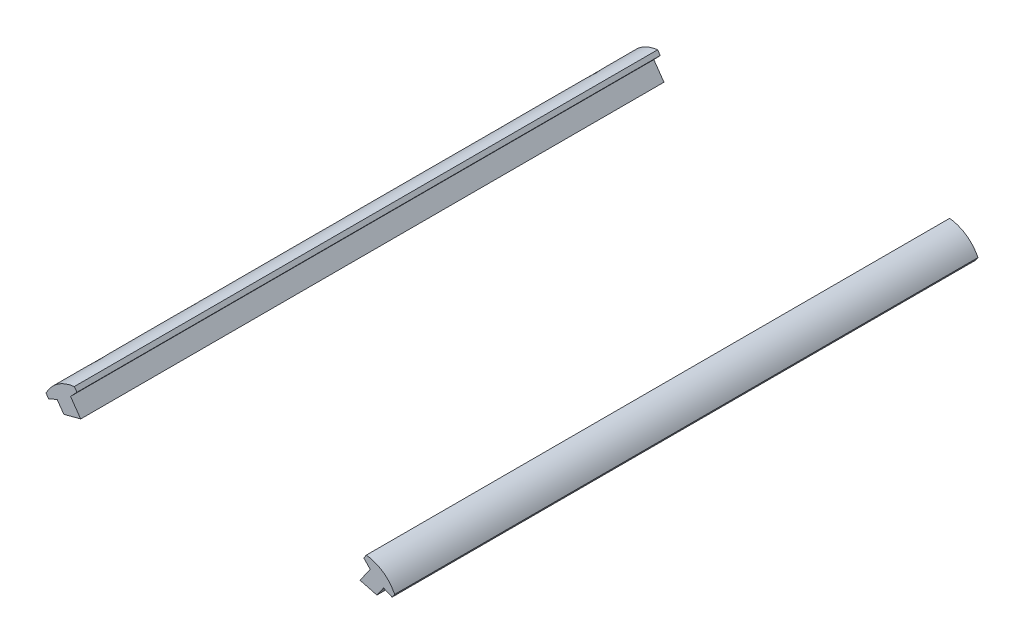
ISO-10303-21;
HEADER;
FILE_DESCRIPTION(('STEP AP214'),'2;1');
FILE_NAME('part.step','',(''),(''),'','','');
FILE_SCHEMA(('AUTOMOTIVE_DESIGN { 1 0 10303 214 1 1 1 1 }'));
ENDSEC;
DATA;
#1=APPLICATION_CONTEXT('core data for automotive mechanical design processes');
#2=APPLICATION_PROTOCOL_DEFINITION('international standard','automotive_design',2000,#1);
#3=PRODUCT_CONTEXT('',#1,'mechanical');
#4=PRODUCT('Part','Part','',(#3));
#5=PRODUCT_RELATED_PRODUCT_CATEGORY('part','',(#4));
#6=PRODUCT_DEFINITION_FORMATION('','',#4);
#7=PRODUCT_DEFINITION_CONTEXT('part definition',#1,'design');
#8=PRODUCT_DEFINITION('design','',#6,#7);
#9=PRODUCT_DEFINITION_SHAPE('','',#8);
#10=(LENGTH_UNIT() NAMED_UNIT(*) SI_UNIT(.MILLI.,.METRE.));
#11=(NAMED_UNIT(*) PLANE_ANGLE_UNIT() SI_UNIT($,.RADIAN.));
#12=(NAMED_UNIT(*) SI_UNIT($,.STERADIAN.) SOLID_ANGLE_UNIT());
#13=UNCERTAINTY_MEASURE_WITH_UNIT(LENGTH_MEASURE(1.E-05),#10,'distance_accuracy_value','');
#14=(GEOMETRIC_REPRESENTATION_CONTEXT(3) GLOBAL_UNCERTAINTY_ASSIGNED_CONTEXT((#13)) GLOBAL_UNIT_ASSIGNED_CONTEXT((#10,
#11,#12)) REPRESENTATION_CONTEXT('',''));
#15=CARTESIAN_POINT('',(0.,0.,0.));
#16=DIRECTION('',(0.,0.,1.));
#17=DIRECTION('',(1.,0.,0.));
#18=AXIS2_PLACEMENT_3D('',#15,#16,#17);
#19=CARTESIAN_POINT('',(0.,0.,152.4));
#20=DIRECTION('',(0.,0.,-1.));
#21=DIRECTION('',(-1.,0.,0.));
#22=AXIS2_PLACEMENT_3D('',#19,#20,#21);
#23=CYLINDRICAL_SURFACE('',#22,152.4);
#24=CARTESIAN_POINT('',(0.,0.,0.));
#25=DIRECTION('',(0.,0.,-1.));
#26=DIRECTION('',(1.,0.,0.));
#27=AXIS2_PLACEMENT_3D('',#24,#25,#26);
#28=CIRCLE('',#27,152.4);
#29=CARTESIAN_POINT('',(36.4912257801325,147.966720721463,0.));
#30=VERTEX_POINT('',#29);
#31=CARTESIAN_POINT('',(40.8893179170161,146.812205488104,0.));
#32=VERTEX_POINT('',#31);
#33=EDGE_CURVE('E139',#30,#32,#28,.T.);
#34=ORIENTED_EDGE('',*,*,#33,.T.);
#35=DIRECTION('',(0.,0.,-1.));
#36=VECTOR('',#35,1.);
#37=CARTESIAN_POINT('',(40.8893179170161,146.812205488104,152.4));
#38=LINE('',#37,#36);
#39=CARTESIAN_POINT('',(40.8893179170161,146.812205488104,152.4));
#40=VERTEX_POINT('',#39);
#41=EDGE_CURVE('E12',#40,#32,#38,.T.);
#42=ORIENTED_EDGE('',*,*,#41,.F.);
#43=CARTESIAN_POINT('',(0.,0.,152.4));
#44=DIRECTION('',(0.,0.,-1.));
#45=DIRECTION('',(1.,0.,0.));
#46=AXIS2_PLACEMENT_3D('',#43,#44,#45);
#47=CIRCLE('',#46,152.4);
#48=CARTESIAN_POINT('',(36.4912257801325,147.966720721463,152.4));
#49=VERTEX_POINT('',#48);
#50=EDGE_CURVE('E158',#49,#40,#47,.T.);
#51=ORIENTED_EDGE('',*,*,#50,.F.);
#52=DIRECTION('',(0.,0.,-1.));
#53=VECTOR('',#52,1.);
#54=CARTESIAN_POINT('',(36.4912257801325,147.966720721463,152.4));
#55=LINE('',#54,#53);
#56=EDGE_CURVE('E135',#49,#30,#55,.T.);
#57=ORIENTED_EDGE('',*,*,#56,.T.);
#58=EDGE_LOOP('',(#34,#42,#51,#57));
#59=FACE_BOUND('',#58,.T.);
#60=ADVANCED_FACE('F43',(#59),#23,.F.);
#61=CARTESIAN_POINT('',(40.8893179170161,146.812205488104,152.4));
#62=DIRECTION('',(-0.819209039548017,0.573495030076822,0.));
#63=DIRECTION('',(-0.573495030076822,-0.819209039548017,0.));
#64=AXIS2_PLACEMENT_3D('',#61,#62,#63);
#65=PLANE('',#64);
#66=DIRECTION('',(0.573495030076822,0.819209039548017,0.));
#67=VECTOR('',#66,1.);
#68=CARTESIAN_POINT('',(40.8893179170161,146.812205488104,0.));
#69=LINE('',#68,#67);
#70=CARTESIAN_POINT('',(42.6364173163982,149.307849819618,0.));
#71=VERTEX_POINT('',#70);
#72=EDGE_CURVE('E142',#32,#71,#69,.T.);
#73=ORIENTED_EDGE('',*,*,#72,.T.);
#74=DIRECTION('',(0.,0.,-1.));
#75=VECTOR('',#74,1.);
#76=CARTESIAN_POINT('',(42.6364173163982,149.307849819618,152.4));
#77=LINE('',#76,#75);
#78=CARTESIAN_POINT('',(42.6364173163982,149.307849819618,152.4));
#79=VERTEX_POINT('',#78);
#80=EDGE_CURVE('E51',#79,#71,#77,.T.);
#81=ORIENTED_EDGE('',*,*,#80,.F.);
#82=DIRECTION('',(0.573495030076822,0.819209039548017,0.));
#83=VECTOR('',#82,1.);
#84=CARTESIAN_POINT('',(40.8893179170161,146.812205488104,152.4));
#85=LINE('',#84,#83);
#86=EDGE_CURVE('E102',#40,#79,#85,.T.);
#87=ORIENTED_EDGE('',*,*,#86,.F.);
#88=ORIENTED_EDGE('',*,*,#41,.T.);
#89=EDGE_LOOP('',(#73,#81,#87,#88));
#90=FACE_BOUND('',#89,.T.);
#91=ADVANCED_FACE('F202',(#90),#65,.F.);
#92=CARTESIAN_POINT('',(42.6364173163982,149.307849819618,152.4));
#93=DIRECTION('',(0.396596742708751,0.917992932256457,0.));
#94=DIRECTION('',(-0.917992932256458,0.396596742708751,0.));
#95=AXIS2_PLACEMENT_3D('',#92,#93,#94);
#96=PLANE('',#95);
#97=DIRECTION('',(0.917992932256457,-0.396596742708751,0.));
#98=VECTOR('',#97,1.);
#99=CARTESIAN_POINT('',(42.6364173163982,149.307849819618,0.));
#100=LINE('',#99,#98);
#101=CARTESIAN_POINT('',(44.8750084067222,148.340720440422,0.));
#102=VERTEX_POINT('',#101);
#103=EDGE_CURVE('E144',#71,#102,#100,.T.);
#104=ORIENTED_EDGE('',*,*,#103,.T.);
#105=DIRECTION('',(0.,0.,-1.));
#106=VECTOR('',#105,1.);
#107=CARTESIAN_POINT('',(44.8750084067222,148.340720440422,152.4));
#108=LINE('',#107,#106);
#109=CARTESIAN_POINT('',(44.8750084067222,148.340720440422,152.4));
#110=VERTEX_POINT('',#109);
#111=EDGE_CURVE('E165',#110,#102,#108,.T.);
#112=ORIENTED_EDGE('',*,*,#111,.F.);
#113=DIRECTION('',(0.917992932256457,-0.396596742708751,0.));
#114=VECTOR('',#113,1.);
#115=CARTESIAN_POINT('',(42.6364173163982,149.307849819618,152.4));
#116=LINE('',#115,#114);
#117=EDGE_CURVE('E173',#79,#110,#116,.T.);
#118=ORIENTED_EDGE('',*,*,#117,.F.);
#119=ORIENTED_EDGE('',*,*,#80,.T.);
#120=EDGE_LOOP('',(#104,#112,#118,#119));
#121=FACE_BOUND('',#120,.T.);
#122=ADVANCED_FACE('F171',(#121),#96,.F.);
#123=CARTESIAN_POINT('',(44.8750084067222,148.340720440422,152.4));
#124=DIRECTION('',(-0.819209039548057,0.573495030076766,0.));
#125=DIRECTION('',(-0.573495030076766,-0.819209039548057,0.));
#126=AXIS2_PLACEMENT_3D('',#123,#124,#125);
#127=PLANE('',#126);
#128=DIRECTION('',(0.573495030076766,0.819209039548057,0.));
#129=VECTOR('',#128,1.);
#130=CARTESIAN_POINT('',(44.8750084067222,148.340720440422,0.));
#131=LINE('',#130,#129);
#132=CARTESIAN_POINT('',(45.552343010576,149.30825913069,0.));
#133=VERTEX_POINT('',#132);
#134=EDGE_CURVE('E146',#102,#133,#131,.T.);
#135=ORIENTED_EDGE('',*,*,#134,.T.);
#136=DIRECTION('',(0.,0.,-1.));
#137=VECTOR('',#136,1.);
#138=CARTESIAN_POINT('',(45.552343010576,149.30825913069,152.4));
#139=LINE('',#138,#137);
#140=CARTESIAN_POINT('',(45.552343010576,149.30825913069,152.4));
#141=VERTEX_POINT('',#140);
#142=EDGE_CURVE('E162',#141,#133,#139,.T.);
#143=ORIENTED_EDGE('',*,*,#142,.F.);
#144=DIRECTION('',(0.573495030076766,0.819209039548057,0.));
#145=VECTOR('',#144,1.);
#146=CARTESIAN_POINT('',(44.8750084067222,148.340720440422,152.4));
#147=LINE('',#146,#145);
#148=EDGE_CURVE('E185',#110,#141,#147,.T.);
#149=ORIENTED_EDGE('',*,*,#148,.F.);
#150=ORIENTED_EDGE('',*,*,#111,.T.);
#151=EDGE_LOOP('',(#135,#143,#149,#150));
#152=FACE_BOUND('',#151,.T.);
#153=ADVANCED_FACE('F181',(#152),#127,.F.);
#154=CARTESIAN_POINT('',(45.552343010576,149.30825913069,152.4));
#155=CARTESIAN_POINT('',(43.1806492590824,153.80374321664,152.4));
#156=CARTESIAN_POINT('',(38.144971739446,154.493859392463,152.4));
#157=B_SPLINE_CURVE_WITH_KNOTS('',2,(#154,#155,#156),.UNSPECIFIED.,.F.,.F.,(3,3),(0.,1.),.UNSPECIFIED.);
#158=DIRECTION('',(0.,0.,-1.));
#159=VECTOR('',#158,1.);
#160=SURFACE_OF_LINEAR_EXTRUSION('',#157,#159);
#161=CARTESIAN_POINT('',(45.552343010576,149.30825913069,0.));
#162=CARTESIAN_POINT('',(43.1806492590824,153.80374321664,0.));
#163=CARTESIAN_POINT('',(38.144971739446,154.493859392463,0.));
#164=B_SPLINE_CURVE_WITH_KNOTS('',2,(#161,#162,#163),.UNSPECIFIED.,.F.,.F.,(3,3),(0.,1.),.UNSPECIFIED.);
#165=CARTESIAN_POINT('',(38.144971739446,154.493859392463,0.));
#166=VERTEX_POINT('',#165);
#167=EDGE_CURVE('E148',#133,#166,#164,.T.);
#168=ORIENTED_EDGE('',*,*,#167,.T.);
#169=DIRECTION('',(0.,0.,-1.));
#170=VECTOR('',#169,1.);
#171=CARTESIAN_POINT('',(38.144971739446,154.493859392463,152.4));
#172=LINE('',#171,#170);
#173=CARTESIAN_POINT('',(38.144971739446,154.493859392463,152.4));
#174=VERTEX_POINT('',#173);
#175=EDGE_CURVE('E130',#174,#166,#172,.T.);
#176=ORIENTED_EDGE('',*,*,#175,.F.);
#177=EDGE_CURVE('E121',#141,#174,#157,.T.);
#178=ORIENTED_EDGE('',*,*,#177,.F.);
#179=ORIENTED_EDGE('',*,*,#142,.T.);
#180=EDGE_LOOP('',(#168,#176,#178,#179));
#181=FACE_BOUND('',#180,.T.);
#182=ADVANCED_FACE('F184',(#181),#160,.F.);
#183=CARTESIAN_POINT('',(37.467637135592,153.526320702195,152.4));
#184=DIRECTION('',(0.819209039548011,-0.57349503007683,0.));
#185=DIRECTION('',(0.57349503007683,0.819209039548011,0.));
#186=AXIS2_PLACEMENT_3D('',#183,#184,#185);
#187=PLANE('',#186);
#188=DIRECTION('',(-0.57349503007683,-0.819209039548011,0.));
#189=VECTOR('',#188,1.);
#190=CARTESIAN_POINT('',(37.467637135592,153.526320702195,0.));
#191=LINE('',#190,#189);
#192=CARTESIAN_POINT('',(37.467637135592,153.526320702195,0.));
#193=VERTEX_POINT('',#192);
#194=EDGE_CURVE('E129',#166,#193,#191,.T.);
#195=ORIENTED_EDGE('',*,*,#194,.T.);
#196=DIRECTION('',(0.,0.,-1.));
#197=VECTOR('',#196,1.);
#198=CARTESIAN_POINT('',(37.467637135592,153.526320702195,152.4));
#199=LINE('',#198,#197);
#200=CARTESIAN_POINT('',(37.467637135592,153.526320702195,152.4));
#201=VERTEX_POINT('',#200);
#202=EDGE_CURVE('E126',#201,#193,#199,.T.);
#203=ORIENTED_EDGE('',*,*,#202,.F.);
#204=DIRECTION('',(-0.57349503007683,-0.819209039548011,0.));
#205=VECTOR('',#204,1.);
#206=CARTESIAN_POINT('',(37.467637135592,153.526320702195,152.4));
#207=LINE('',#206,#205);
#208=EDGE_CURVE('E115',#174,#201,#207,.T.);
#209=ORIENTED_EDGE('',*,*,#208,.F.);
#210=ORIENTED_EDGE('',*,*,#175,.T.);
#211=EDGE_LOOP('',(#195,#203,#209,#210));
#212=FACE_BOUND('',#211,.T.);
#213=ADVANCED_FACE('F127',(#212),#187,.F.);
#214=CARTESIAN_POINT('',(39.1424370359007,151.753843734867,152.4));
#215=DIRECTION('',(0.726850622977677,0.686795582307402,0.));
#216=DIRECTION('',(-0.686795582307402,0.726850622977677,0.));
#217=AXIS2_PLACEMENT_3D('',#214,#215,#216);
#218=PLANE('',#217);
#219=DIRECTION('',(0.686795582307402,-0.726850622977677,0.));
#220=VECTOR('',#219,1.);
#221=CARTESIAN_POINT('',(39.1424370359007,151.753843734867,0.));
#222=LINE('',#221,#220);
#223=CARTESIAN_POINT('',(39.1424370359007,151.753843734867,0.));
#224=VERTEX_POINT('',#223);
#225=EDGE_CURVE('E88',#193,#224,#222,.T.);
#226=ORIENTED_EDGE('',*,*,#225,.T.);
#227=DIRECTION('',(0.,0.,-1.));
#228=VECTOR('',#227,1.);
#229=CARTESIAN_POINT('',(39.1424370359007,151.753843734867,152.4));
#230=LINE('',#229,#228);
#231=CARTESIAN_POINT('',(39.1424370359007,151.753843734867,152.4));
#232=VERTEX_POINT('',#231);
#233=EDGE_CURVE('E131',#232,#224,#230,.T.);
#234=ORIENTED_EDGE('',*,*,#233,.F.);
#235=DIRECTION('',(0.686795582307402,-0.726850622977677,0.));
#236=VECTOR('',#235,1.);
#237=CARTESIAN_POINT('',(39.1424370359007,151.753843734867,152.4));
#238=LINE('',#237,#236);
#239=EDGE_CURVE('E119',#201,#232,#238,.T.);
#240=ORIENTED_EDGE('',*,*,#239,.F.);
#241=ORIENTED_EDGE('',*,*,#202,.T.);
#242=EDGE_LOOP('',(#226,#234,#240,#241));
#243=FACE_BOUND('',#242,.T.);
#244=ADVANCED_FACE('F133',(#243),#218,.F.);
#245=CARTESIAN_POINT('',(36.4912257801325,147.966720721463,152.4));
#246=DIRECTION('',(0.819209039548021,-0.573495030076817,0.));
#247=DIRECTION('',(0.573495030076817,0.819209039548021,0.));
#248=AXIS2_PLACEMENT_3D('',#245,#246,#247);
#249=PLANE('',#248);
#250=DIRECTION('',(-0.573495030076817,-0.819209039548021,0.));
#251=VECTOR('',#250,1.);
#252=CARTESIAN_POINT('',(36.4912257801325,147.966720721463,0.));
#253=LINE('',#252,#251);
#254=EDGE_CURVE('E94',#224,#30,#253,.T.);
#255=ORIENTED_EDGE('',*,*,#254,.T.);
#256=ORIENTED_EDGE('',*,*,#56,.F.);
#257=DIRECTION('',(-0.573495030076817,-0.819209039548021,0.));
#258=VECTOR('',#257,1.);
#259=CARTESIAN_POINT('',(36.4912257801325,147.966720721463,152.4));
#260=LINE('',#259,#258);
#261=EDGE_CURVE('E59',#232,#49,#260,.T.);
#262=ORIENTED_EDGE('',*,*,#261,.F.);
#263=ORIENTED_EDGE('',*,*,#233,.T.);
#264=EDGE_LOOP('',(#255,#256,#262,#263));
#265=FACE_BOUND('',#264,.T.);
#266=ADVANCED_FACE('F210',(#265),#249,.F.);
#267=CARTESIAN_POINT('',(0.,0.,152.4));
#268=DIRECTION('',(0.,0.,1.));
#269=DIRECTION('',(1.,0.,0.));
#270=AXIS2_PLACEMENT_3D('',#267,#268,#269);
#271=PLANE('',#270);
#272=ORIENTED_EDGE('',*,*,#50,.T.);
#273=ORIENTED_EDGE('',*,*,#86,.T.);
#274=ORIENTED_EDGE('',*,*,#117,.T.);
#275=ORIENTED_EDGE('',*,*,#148,.T.);
#276=ORIENTED_EDGE('',*,*,#177,.T.);
#277=ORIENTED_EDGE('',*,*,#208,.T.);
#278=ORIENTED_EDGE('',*,*,#239,.T.);
#279=ORIENTED_EDGE('',*,*,#261,.T.);
#280=EDGE_LOOP('',(#272,#273,#274,#275,#276,#277,#278,#279));
#281=FACE_BOUND('',#280,.T.);
#282=ADVANCED_FACE('F117',(#281),#271,.T.);
#283=CARTESIAN_POINT('',(0.,0.,0.));
#284=DIRECTION('',(0.,0.,1.));
#285=DIRECTION('',(1.,0.,0.));
#286=AXIS2_PLACEMENT_3D('',#283,#284,#285);
#287=PLANE('',#286);
#288=ORIENTED_EDGE('',*,*,#33,.F.);
#289=ORIENTED_EDGE('',*,*,#254,.F.);
#290=ORIENTED_EDGE('',*,*,#225,.F.);
#291=ORIENTED_EDGE('',*,*,#194,.F.);
#292=ORIENTED_EDGE('',*,*,#167,.F.);
#293=ORIENTED_EDGE('',*,*,#134,.F.);
#294=ORIENTED_EDGE('',*,*,#103,.F.);
#295=ORIENTED_EDGE('',*,*,#72,.F.);
#296=EDGE_LOOP('',(#288,#289,#290,#291,#292,#293,#294,#295));
#297=FACE_BOUND('',#296,.T.);
#298=ADVANCED_FACE('F177',(#297),#287,.F.);
#299=CLOSED_SHELL('',(#60,#91,#122,#153,#182,#213,#244,#266,#282,#298));
#300=MANIFOLD_SOLID_BREP('B2',#299);
#301=CARTESIAN_POINT('',(0.,0.,152.4));
#302=DIRECTION('',(0.,0.,-1.));
#303=DIRECTION('',(-1.,0.,0.));
#304=AXIS2_PLACEMENT_3D('',#301,#302,#303);
#305=CYLINDRICAL_SURFACE('',#304,152.4);
#306=CARTESIAN_POINT('',(0.,0.,0.));
#307=DIRECTION('',(0.,0.,-1.));
#308=DIRECTION('',(1.,0.,0.));
#309=AXIS2_PLACEMENT_3D('',#306,#307,#308);
#310=CIRCLE('',#309,152.4);
#311=CARTESIAN_POINT('',(-40.8893179170162,146.812205488104,0.));
#312=VERTEX_POINT('',#311);
#313=CARTESIAN_POINT('',(-36.4912257801324,147.966720721463,0.));
#314=VERTEX_POINT('',#313);
#315=EDGE_CURVE('E378',#312,#314,#310,.T.);
#316=ORIENTED_EDGE('',*,*,#315,.T.);
#317=DIRECTION('',(0.,0.,-1.));
#318=VECTOR('',#317,1.);
#319=CARTESIAN_POINT('',(-36.4912257801324,147.966720721463,152.4));
#320=LINE('',#319,#318);
#321=CARTESIAN_POINT('',(-36.4912257801324,147.966720721463,152.4));
#322=VERTEX_POINT('',#321);
#323=EDGE_CURVE('E41',#322,#314,#320,.T.);
#324=ORIENTED_EDGE('',*,*,#323,.F.);
#325=CARTESIAN_POINT('',(0.,0.,152.4));
#326=DIRECTION('',(0.,0.,-1.));
#327=DIRECTION('',(1.,0.,0.));
#328=AXIS2_PLACEMENT_3D('',#325,#326,#327);
#329=CIRCLE('',#328,152.4);
#330=CARTESIAN_POINT('',(-40.8893179170162,146.812205488104,152.4));
#331=VERTEX_POINT('',#330);
#332=EDGE_CURVE('E397',#331,#322,#329,.T.);
#333=ORIENTED_EDGE('',*,*,#332,.F.);
#334=DIRECTION('',(0.,0.,-1.));
#335=VECTOR('',#334,1.);
#336=CARTESIAN_POINT('',(-40.8893179170162,146.812205488104,152.4));
#337=LINE('',#336,#335);
#338=EDGE_CURVE('E374',#331,#312,#337,.T.);
#339=ORIENTED_EDGE('',*,*,#338,.T.);
#340=EDGE_LOOP('',(#316,#324,#333,#339));
#341=FACE_BOUND('',#340,.T.);
#342=ADVANCED_FACE('F282',(#341),#305,.F.);
#343=CARTESIAN_POINT('',(-36.4912257801324,147.966720721463,152.4));
#344=DIRECTION('',(-0.819209039548009,-0.573495030076833,0.));
#345=DIRECTION('',(0.573495030076833,-0.81920903954801,0.));
#346=AXIS2_PLACEMENT_3D('',#343,#344,#345);
#347=PLANE('',#346);
#348=DIRECTION('',(-0.573495030076833,0.819209039548009,0.));
#349=VECTOR('',#348,1.);
#350=CARTESIAN_POINT('',(-36.4912257801324,147.966720721463,0.));
#351=LINE('',#350,#349);
#352=CARTESIAN_POINT('',(-39.1424370359007,151.753843734867,0.));
#353=VERTEX_POINT('',#352);
#354=EDGE_CURVE('E381',#314,#353,#351,.T.);
#355=ORIENTED_EDGE('',*,*,#354,.T.);
#356=DIRECTION('',(0.,0.,-1.));
#357=VECTOR('',#356,1.);
#358=CARTESIAN_POINT('',(-39.1424370359007,151.753843734867,152.4));
#359=LINE('',#358,#357);
#360=CARTESIAN_POINT('',(-39.1424370359007,151.753843734867,152.4));
#361=VERTEX_POINT('',#360);
#362=EDGE_CURVE('E290',#361,#353,#359,.T.);
#363=ORIENTED_EDGE('',*,*,#362,.F.);
#364=DIRECTION('',(-0.573495030076833,0.819209039548009,0.));
#365=VECTOR('',#364,1.);
#366=CARTESIAN_POINT('',(-36.4912257801324,147.966720721463,152.4));
#367=LINE('',#366,#365);
#368=EDGE_CURVE('E341',#322,#361,#367,.T.);
#369=ORIENTED_EDGE('',*,*,#368,.F.);
#370=ORIENTED_EDGE('',*,*,#323,.T.);
#371=EDGE_LOOP('',(#355,#363,#369,#370));
#372=FACE_BOUND('',#371,.T.);
#373=ADVANCED_FACE('F441',(#372),#347,.F.);
#374=CARTESIAN_POINT('',(-39.1424370359007,151.753843734867,152.4));
#375=DIRECTION('',(-0.726850622977677,0.686795582307402,0.));
#376=DIRECTION('',(-0.686795582307402,-0.726850622977677,0.));
#377=AXIS2_PLACEMENT_3D('',#374,#375,#376);
#378=PLANE('',#377);
#379=DIRECTION('',(0.686795582307402,0.726850622977677,0.));
#380=VECTOR('',#379,1.);
#381=CARTESIAN_POINT('',(-39.1424370359007,151.753843734867,0.));
#382=LINE('',#381,#380);
#383=CARTESIAN_POINT('',(-37.467637135592,153.526320702195,0.));
#384=VERTEX_POINT('',#383);
#385=EDGE_CURVE('E383',#353,#384,#382,.T.);
#386=ORIENTED_EDGE('',*,*,#385,.T.);
#387=DIRECTION('',(0.,0.,-1.));
#388=VECTOR('',#387,1.);
#389=CARTESIAN_POINT('',(-37.467637135592,153.526320702195,152.4));
#390=LINE('',#389,#388);
#391=CARTESIAN_POINT('',(-37.467637135592,153.526320702195,152.4));
#392=VERTEX_POINT('',#391);
#393=EDGE_CURVE('E404',#392,#384,#390,.T.);
#394=ORIENTED_EDGE('',*,*,#393,.F.);
#395=DIRECTION('',(0.686795582307402,0.726850622977677,0.));
#396=VECTOR('',#395,1.);
#397=CARTESIAN_POINT('',(-39.1424370359007,151.753843734867,152.4));
#398=LINE('',#397,#396);
#399=EDGE_CURVE('E412',#361,#392,#398,.T.);
#400=ORIENTED_EDGE('',*,*,#399,.F.);
#401=ORIENTED_EDGE('',*,*,#362,.T.);
#402=EDGE_LOOP('',(#386,#394,#400,#401));
#403=FACE_BOUND('',#402,.T.);
#404=ADVANCED_FACE('F410',(#403),#378,.F.);
#405=CARTESIAN_POINT('',(-37.467637135592,153.526320702195,152.4));
#406=DIRECTION('',(-0.819209039548011,-0.57349503007683,0.));
#407=DIRECTION('',(0.57349503007683,-0.819209039548011,0.));
#408=AXIS2_PLACEMENT_3D('',#405,#406,#407);
#409=PLANE('',#408);
#410=DIRECTION('',(-0.57349503007683,0.819209039548011,0.));
#411=VECTOR('',#410,1.);
#412=CARTESIAN_POINT('',(-37.467637135592,153.526320702195,0.));
#413=LINE('',#412,#411);
#414=CARTESIAN_POINT('',(-38.144971739446,154.493859392463,0.));
#415=VERTEX_POINT('',#414);
#416=EDGE_CURVE('E385',#384,#415,#413,.T.);
#417=ORIENTED_EDGE('',*,*,#416,.T.);
#418=DIRECTION('',(0.,0.,-1.));
#419=VECTOR('',#418,1.);
#420=CARTESIAN_POINT('',(-38.144971739446,154.493859392463,152.4));
#421=LINE('',#420,#419);
#422=CARTESIAN_POINT('',(-38.144971739446,154.493859392463,152.4));
#423=VERTEX_POINT('',#422);
#424=EDGE_CURVE('E401',#423,#415,#421,.T.);
#425=ORIENTED_EDGE('',*,*,#424,.F.);
#426=DIRECTION('',(-0.57349503007683,0.819209039548011,0.));
#427=VECTOR('',#426,1.);
#428=CARTESIAN_POINT('',(-37.467637135592,153.526320702195,152.4));
#429=LINE('',#428,#427);
#430=EDGE_CURVE('E424',#392,#423,#429,.T.);
#431=ORIENTED_EDGE('',*,*,#430,.F.);
#432=ORIENTED_EDGE('',*,*,#393,.T.);
#433=EDGE_LOOP('',(#417,#425,#431,#432));
#434=FACE_BOUND('',#433,.T.);
#435=ADVANCED_FACE('F420',(#434),#409,.F.);
#436=CARTESIAN_POINT('',(-38.144971739446,154.493859392463,152.4));
#437=CARTESIAN_POINT('',(-43.1806492590824,153.80374321664,152.4));
#438=CARTESIAN_POINT('',(-45.552343010576,149.30825913069,152.4));
#439=B_SPLINE_CURVE_WITH_KNOTS('',2,(#436,#437,#438),.UNSPECIFIED.,.F.,.F.,(3,3),(0.,1.),.UNSPECIFIED.);
#440=DIRECTION('',(0.,0.,-1.));
#441=VECTOR('',#440,1.);
#442=SURFACE_OF_LINEAR_EXTRUSION('',#439,#441);
#443=CARTESIAN_POINT('',(-38.144971739446,154.493859392463,0.));
#444=CARTESIAN_POINT('',(-43.1806492590824,153.80374321664,0.));
#445=CARTESIAN_POINT('',(-45.552343010576,149.30825913069,0.));
#446=B_SPLINE_CURVE_WITH_KNOTS('',2,(#443,#444,#445),.UNSPECIFIED.,.F.,.F.,(3,3),(0.,1.),.UNSPECIFIED.);
#447=CARTESIAN_POINT('',(-45.552343010576,149.30825913069,0.));
#448=VERTEX_POINT('',#447);
#449=EDGE_CURVE('E387',#415,#448,#446,.T.);
#450=ORIENTED_EDGE('',*,*,#449,.T.);
#451=DIRECTION('',(0.,0.,-1.));
#452=VECTOR('',#451,1.);
#453=CARTESIAN_POINT('',(-45.552343010576,149.30825913069,152.4));
#454=LINE('',#453,#452);
#455=CARTESIAN_POINT('',(-45.552343010576,149.30825913069,152.4));
#456=VERTEX_POINT('',#455);
#457=EDGE_CURVE('E369',#456,#448,#454,.T.);
#458=ORIENTED_EDGE('',*,*,#457,.F.);
#459=EDGE_CURVE('E360',#423,#456,#439,.T.);
#460=ORIENTED_EDGE('',*,*,#459,.F.);
#461=ORIENTED_EDGE('',*,*,#424,.T.);
#462=EDGE_LOOP('',(#450,#458,#460,#461));
#463=FACE_BOUND('',#462,.T.);
#464=ADVANCED_FACE('F423',(#463),#442,.F.);
#465=CARTESIAN_POINT('',(-44.8750084067222,148.340720440422,152.4));
#466=DIRECTION('',(0.819209039547993,0.573495030076857,0.));
#467=DIRECTION('',(-0.573495030076857,0.819209039547993,0.));
#468=AXIS2_PLACEMENT_3D('',#465,#466,#467);
#469=PLANE('',#468);
#470=DIRECTION('',(0.573495030076857,-0.819209039547993,0.));
#471=VECTOR('',#470,1.);
#472=CARTESIAN_POINT('',(-44.8750084067222,148.340720440422,0.));
#473=LINE('',#472,#471);
#474=CARTESIAN_POINT('',(-44.8750084067222,148.340720440422,0.));
#475=VERTEX_POINT('',#474);
#476=EDGE_CURVE('E368',#448,#475,#473,.T.);
#477=ORIENTED_EDGE('',*,*,#476,.T.);
#478=DIRECTION('',(0.,0.,-1.));
#479=VECTOR('',#478,1.);
#480=CARTESIAN_POINT('',(-44.8750084067222,148.340720440422,152.4));
#481=LINE('',#480,#479);
#482=CARTESIAN_POINT('',(-44.8750084067222,148.340720440422,152.4));
#483=VERTEX_POINT('',#482);
#484=EDGE_CURVE('E365',#483,#475,#481,.T.);
#485=ORIENTED_EDGE('',*,*,#484,.F.);
#486=DIRECTION('',(0.573495030076857,-0.819209039547993,0.));
#487=VECTOR('',#486,1.);
#488=CARTESIAN_POINT('',(-44.8750084067222,148.340720440422,152.4));
#489=LINE('',#488,#487);
#490=EDGE_CURVE('E354',#456,#483,#489,.T.);
#491=ORIENTED_EDGE('',*,*,#490,.F.);
#492=ORIENTED_EDGE('',*,*,#457,.T.);
#493=EDGE_LOOP('',(#477,#485,#491,#492));
#494=FACE_BOUND('',#493,.T.);
#495=ADVANCED_FACE('F366',(#494),#469,.F.);
#496=CARTESIAN_POINT('',(-42.6364173163982,149.307849819618,152.4));
#497=DIRECTION('',(-0.396596742708732,0.917992932256466,0.));
#498=DIRECTION('',(-0.917992932256466,-0.396596742708732,0.));
#499=AXIS2_PLACEMENT_3D('',#496,#497,#498);
#500=PLANE('',#499);
#501=DIRECTION('',(0.917992932256466,0.396596742708732,0.));
#502=VECTOR('',#501,1.);
#503=CARTESIAN_POINT('',(-42.6364173163982,149.307849819618,0.));
#504=LINE('',#503,#502);
#505=CARTESIAN_POINT('',(-42.6364173163982,149.307849819618,0.));
#506=VERTEX_POINT('',#505);
#507=EDGE_CURVE('E327',#475,#506,#504,.T.);
#508=ORIENTED_EDGE('',*,*,#507,.T.);
#509=DIRECTION('',(0.,0.,-1.));
#510=VECTOR('',#509,1.);
#511=CARTESIAN_POINT('',(-42.6364173163982,149.307849819618,152.4));
#512=LINE('',#511,#510);
#513=CARTESIAN_POINT('',(-42.6364173163982,149.307849819618,152.4));
#514=VERTEX_POINT('',#513);
#515=EDGE_CURVE('E370',#514,#506,#512,.T.);
#516=ORIENTED_EDGE('',*,*,#515,.F.);
#517=DIRECTION('',(0.917992932256466,0.396596742708732,0.));
#518=VECTOR('',#517,1.);
#519=CARTESIAN_POINT('',(-42.6364173163982,149.307849819618,152.4));
#520=LINE('',#519,#518);
#521=EDGE_CURVE('E358',#483,#514,#520,.T.);
#522=ORIENTED_EDGE('',*,*,#521,.F.);
#523=ORIENTED_EDGE('',*,*,#484,.T.);
#524=EDGE_LOOP('',(#508,#516,#522,#523));
#525=FACE_BOUND('',#524,.T.);
#526=ADVANCED_FACE('F372',(#525),#500,.F.);
#527=CARTESIAN_POINT('',(-40.8893179170162,146.812205488104,152.4));
#528=DIRECTION('',(0.819209039548022,0.573495030076816,0.));
#529=DIRECTION('',(-0.573495030076816,0.819209039548022,0.));
#530=AXIS2_PLACEMENT_3D('',#527,#528,#529);
#531=PLANE('',#530);
#532=DIRECTION('',(0.573495030076816,-0.819209039548022,0.));
#533=VECTOR('',#532,1.);
#534=CARTESIAN_POINT('',(-40.8893179170162,146.812205488104,0.));
#535=LINE('',#534,#533);
#536=EDGE_CURVE('E333',#506,#312,#535,.T.);
#537=ORIENTED_EDGE('',*,*,#536,.T.);
#538=ORIENTED_EDGE('',*,*,#338,.F.);
#539=DIRECTION('',(0.573495030076816,-0.819209039548022,0.));
#540=VECTOR('',#539,1.);
#541=CARTESIAN_POINT('',(-40.8893179170162,146.812205488104,152.4));
#542=LINE('',#541,#540);
#543=EDGE_CURVE('E298',#514,#331,#542,.T.);
#544=ORIENTED_EDGE('',*,*,#543,.F.);
#545=ORIENTED_EDGE('',*,*,#515,.T.);
#546=EDGE_LOOP('',(#537,#538,#544,#545));
#547=FACE_BOUND('',#546,.T.);
#548=ADVANCED_FACE('F449',(#547),#531,.F.);
#549=CARTESIAN_POINT('',(0.,0.,152.4));
#550=DIRECTION('',(0.,0.,1.));
#551=DIRECTION('',(1.,0.,0.));
#552=AXIS2_PLACEMENT_3D('',#549,#550,#551);
#553=PLANE('',#552);
#554=ORIENTED_EDGE('',*,*,#332,.T.);
#555=ORIENTED_EDGE('',*,*,#368,.T.);
#556=ORIENTED_EDGE('',*,*,#399,.T.);
#557=ORIENTED_EDGE('',*,*,#430,.T.);
#558=ORIENTED_EDGE('',*,*,#459,.T.);
#559=ORIENTED_EDGE('',*,*,#490,.T.);
#560=ORIENTED_EDGE('',*,*,#521,.T.);
#561=ORIENTED_EDGE('',*,*,#543,.T.);
#562=EDGE_LOOP('',(#554,#555,#556,#557,#558,#559,#560,#561));
#563=FACE_BOUND('',#562,.T.);
#564=ADVANCED_FACE('F356',(#563),#553,.T.);
#565=CARTESIAN_POINT('',(0.,0.,0.));
#566=DIRECTION('',(0.,0.,1.));
#567=DIRECTION('',(1.,0.,0.));
#568=AXIS2_PLACEMENT_3D('',#565,#566,#567);
#569=PLANE('',#568);
#570=ORIENTED_EDGE('',*,*,#315,.F.);
#571=ORIENTED_EDGE('',*,*,#536,.F.);
#572=ORIENTED_EDGE('',*,*,#507,.F.);
#573=ORIENTED_EDGE('',*,*,#476,.F.);
#574=ORIENTED_EDGE('',*,*,#449,.F.);
#575=ORIENTED_EDGE('',*,*,#416,.F.);
#576=ORIENTED_EDGE('',*,*,#385,.F.);
#577=ORIENTED_EDGE('',*,*,#354,.F.);
#578=EDGE_LOOP('',(#570,#571,#572,#573,#574,#575,#576,#577));
#579=FACE_BOUND('',#578,.T.);
#580=ADVANCED_FACE('F416',(#579),#569,.F.);
#581=CLOSED_SHELL('',(#342,#373,#404,#435,#464,#495,#526,#548,#564,#580));
#582=MANIFOLD_SOLID_BREP('B6',#581);
#583=ADVANCED_BREP_SHAPE_REPRESENTATION('',(#18,#300,#582),#14);
#584=SHAPE_DEFINITION_REPRESENTATION(#9,#583);
ENDSEC;
END-ISO-10303-21;
